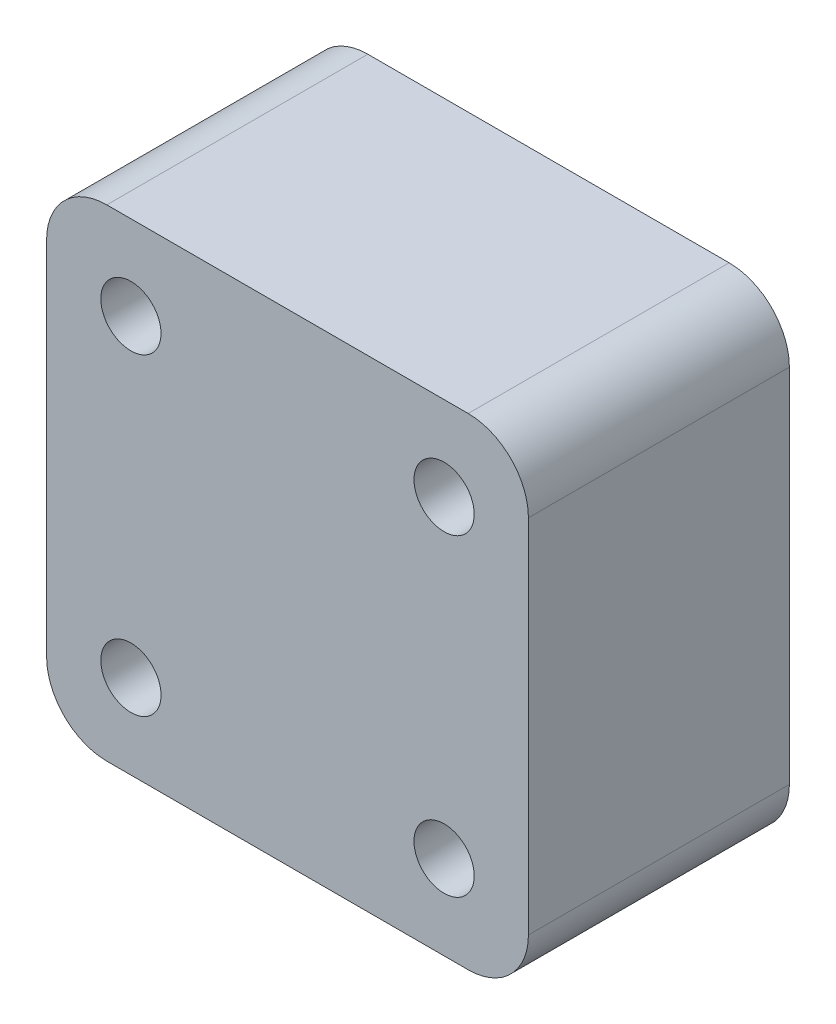
ISO-10303-21;
HEADER;
FILE_DESCRIPTION(('STEP AP214'),'2;1');
FILE_NAME('part.step','',(''),(''),'','','');
FILE_SCHEMA(('AUTOMOTIVE_DESIGN { 1 0 10303 214 1 1 1 1 }'));
ENDSEC;
DATA;
#1=APPLICATION_CONTEXT('core data for automotive mechanical design processes');
#2=APPLICATION_PROTOCOL_DEFINITION('international standard','automotive_design',2000,#1);
#3=PRODUCT_CONTEXT('',#1,'mechanical');
#4=PRODUCT('Part','Part','',(#3));
#5=PRODUCT_RELATED_PRODUCT_CATEGORY('part','',(#4));
#6=PRODUCT_DEFINITION_FORMATION('','',#4);
#7=PRODUCT_DEFINITION_CONTEXT('part definition',#1,'design');
#8=PRODUCT_DEFINITION('design','',#6,#7);
#9=PRODUCT_DEFINITION_SHAPE('','',#8);
#10=(LENGTH_UNIT() NAMED_UNIT(*) SI_UNIT(.MILLI.,.METRE.));
#11=(NAMED_UNIT(*) PLANE_ANGLE_UNIT() SI_UNIT($,.RADIAN.));
#12=(NAMED_UNIT(*) SI_UNIT($,.STERADIAN.) SOLID_ANGLE_UNIT());
#13=UNCERTAINTY_MEASURE_WITH_UNIT(LENGTH_MEASURE(1.E-05),#10,'distance_accuracy_value','');
#14=(GEOMETRIC_REPRESENTATION_CONTEXT(3) GLOBAL_UNCERTAINTY_ASSIGNED_CONTEXT((#13)) GLOBAL_UNIT_ASSIGNED_CONTEXT((#10,
#11,#12)) REPRESENTATION_CONTEXT('',''));
#15=CARTESIAN_POINT('',(0.,0.,0.));
#16=DIRECTION('',(0.,0.,1.));
#17=DIRECTION('',(1.,0.,0.));
#18=AXIS2_PLACEMENT_3D('',#15,#16,#17);
#19=CARTESIAN_POINT('',(24.,-24.,26.));
#20=DIRECTION('',(-1.,0.,0.));
#21=DIRECTION('',(0.,0.,1.));
#22=AXIS2_PLACEMENT_3D('',#19,#20,#21);
#23=PLANE('',#22);
#24=DIRECTION('',(0.,1.,0.));
#25=VECTOR('',#24,1.);
#26=CARTESIAN_POINT('',(24.,-24.,26.));
#27=LINE('',#26,#25);
#28=CARTESIAN_POINT('',(24.,-18.,26.));
#29=VERTEX_POINT('',#28);
#30=CARTESIAN_POINT('',(24.,18.,26.));
#31=VERTEX_POINT('',#30);
#32=EDGE_CURVE('E122',#29,#31,#27,.T.);
#33=ORIENTED_EDGE('',*,*,#32,.F.);
#34=DIRECTION('',(0.,0.,-1.));
#35=VECTOR('',#34,1.);
#36=CARTESIAN_POINT('',(24.,-18.,26.));
#37=LINE('',#36,#35);
#38=CARTESIAN_POINT('',(24.,-18.,0.));
#39=VERTEX_POINT('',#38);
#40=EDGE_CURVE('E107',#29,#39,#37,.T.);
#41=ORIENTED_EDGE('',*,*,#40,.T.);
#42=DIRECTION('',(0.,1.,0.));
#43=VECTOR('',#42,1.);
#44=CARTESIAN_POINT('',(24.,-24.,0.));
#45=LINE('',#44,#43);
#46=CARTESIAN_POINT('',(24.,18.,0.));
#47=VERTEX_POINT('',#46);
#48=EDGE_CURVE('E119',#39,#47,#45,.T.);
#49=ORIENTED_EDGE('',*,*,#48,.T.);
#50=DIRECTION('',(0.,0.,-1.));
#51=VECTOR('',#50,1.);
#52=CARTESIAN_POINT('',(24.,18.,26.));
#53=LINE('',#52,#51);
#54=EDGE_CURVE('E124',#47,#31,#53,.F.);
#55=ORIENTED_EDGE('',*,*,#54,.T.);
#56=EDGE_LOOP('',(#33,#41,#49,#55));
#57=FACE_BOUND('',#56,.T.);
#58=ADVANCED_FACE('F36',(#57),#23,.F.);
#59=CARTESIAN_POINT('',(-24.,24.,26.));
#60=DIRECTION('',(0.,-1.,0.));
#61=DIRECTION('',(0.,0.,-1.));
#62=AXIS2_PLACEMENT_3D('',#59,#60,#61);
#63=PLANE('',#62);
#64=DIRECTION('',(-1.,0.,0.));
#65=VECTOR('',#64,1.);
#66=CARTESIAN_POINT('',(-24.,24.,26.));
#67=LINE('',#66,#65);
#68=CARTESIAN_POINT('',(18.,24.,26.));
#69=VERTEX_POINT('',#68);
#70=CARTESIAN_POINT('',(-18.,24.,26.));
#71=VERTEX_POINT('',#70);
#72=EDGE_CURVE('E166',#69,#71,#67,.T.);
#73=ORIENTED_EDGE('',*,*,#72,.F.);
#74=DIRECTION('',(0.,0.,-1.));
#75=VECTOR('',#74,1.);
#76=CARTESIAN_POINT('',(18.,24.,26.));
#77=LINE('',#76,#75);
#78=CARTESIAN_POINT('',(18.,24.,0.));
#79=VERTEX_POINT('',#78);
#80=EDGE_CURVE('E11',#69,#79,#77,.T.);
#81=ORIENTED_EDGE('',*,*,#80,.T.);
#82=DIRECTION('',(-1.,0.,0.));
#83=VECTOR('',#82,1.);
#84=CARTESIAN_POINT('',(-24.,24.,0.));
#85=LINE('',#84,#83);
#86=CARTESIAN_POINT('',(-18.,24.,0.));
#87=VERTEX_POINT('',#86);
#88=EDGE_CURVE('E129',#79,#87,#85,.T.);
#89=ORIENTED_EDGE('',*,*,#88,.T.);
#90=DIRECTION('',(0.,0.,-1.));
#91=VECTOR('',#90,1.);
#92=CARTESIAN_POINT('',(-18.,24.,26.));
#93=LINE('',#92,#91);
#94=EDGE_CURVE('E44',#87,#71,#93,.F.);
#95=ORIENTED_EDGE('',*,*,#94,.T.);
#96=EDGE_LOOP('',(#73,#81,#89,#95));
#97=FACE_BOUND('',#96,.T.);
#98=ADVANCED_FACE('F165',(#97),#63,.F.);
#99=CARTESIAN_POINT('',(-24.,-24.,26.));
#100=DIRECTION('',(1.,0.,0.));
#101=DIRECTION('',(0.,0.,-1.));
#102=AXIS2_PLACEMENT_3D('',#99,#100,#101);
#103=PLANE('',#102);
#104=DIRECTION('',(0.,-1.,0.));
#105=VECTOR('',#104,1.);
#106=CARTESIAN_POINT('',(-24.,-24.,0.));
#107=LINE('',#106,#105);
#108=CARTESIAN_POINT('',(-24.,18.,0.));
#109=VERTEX_POINT('',#108);
#110=CARTESIAN_POINT('',(-24.,-18.,0.));
#111=VERTEX_POINT('',#110);
#112=EDGE_CURVE('E133',#109,#111,#107,.T.);
#113=ORIENTED_EDGE('',*,*,#112,.T.);
#114=DIRECTION('',(0.,0.,-1.));
#115=VECTOR('',#114,1.);
#116=CARTESIAN_POINT('',(-24.,-18.,26.));
#117=LINE('',#116,#115);
#118=CARTESIAN_POINT('',(-24.,-18.,26.));
#119=VERTEX_POINT('',#118);
#120=EDGE_CURVE('E51',#111,#119,#117,.F.);
#121=ORIENTED_EDGE('',*,*,#120,.T.);
#122=DIRECTION('',(0.,-1.,0.));
#123=VECTOR('',#122,1.);
#124=CARTESIAN_POINT('',(-24.,-24.,26.));
#125=LINE('',#124,#123);
#126=CARTESIAN_POINT('',(-24.,18.,26.));
#127=VERTEX_POINT('',#126);
#128=EDGE_CURVE('E172',#127,#119,#125,.T.);
#129=ORIENTED_EDGE('',*,*,#128,.F.);
#130=DIRECTION('',(0.,0.,-1.));
#131=VECTOR('',#130,1.);
#132=CARTESIAN_POINT('',(-24.,18.,26.));
#133=LINE('',#132,#131);
#134=EDGE_CURVE('E159',#127,#109,#133,.T.);
#135=ORIENTED_EDGE('',*,*,#134,.T.);
#136=EDGE_LOOP('',(#113,#121,#129,#135));
#137=FACE_BOUND('',#136,.T.);
#138=ADVANCED_FACE('F176',(#137),#103,.F.);
#139=CARTESIAN_POINT('',(-24.,-24.,26.));
#140=DIRECTION('',(0.,1.,0.));
#141=DIRECTION('',(0.,0.,1.));
#142=AXIS2_PLACEMENT_3D('',#139,#140,#141);
#143=PLANE('',#142);
#144=DIRECTION('',(1.,0.,0.));
#145=VECTOR('',#144,1.);
#146=CARTESIAN_POINT('',(-24.,-24.,0.));
#147=LINE('',#146,#145);
#148=CARTESIAN_POINT('',(-18.,-24.,0.));
#149=VERTEX_POINT('',#148);
#150=CARTESIAN_POINT('',(18.,-24.,0.));
#151=VERTEX_POINT('',#150);
#152=EDGE_CURVE('E143',#149,#151,#147,.T.);
#153=ORIENTED_EDGE('',*,*,#152,.T.);
#154=DIRECTION('',(0.,0.,-1.));
#155=VECTOR('',#154,1.);
#156=CARTESIAN_POINT('',(18.,-24.,26.));
#157=LINE('',#156,#155);
#158=CARTESIAN_POINT('',(18.,-24.,26.));
#159=VERTEX_POINT('',#158);
#160=EDGE_CURVE('E108',#151,#159,#157,.F.);
#161=ORIENTED_EDGE('',*,*,#160,.T.);
#162=DIRECTION('',(1.,0.,0.));
#163=VECTOR('',#162,1.);
#164=CARTESIAN_POINT('',(-24.,-24.,26.));
#165=LINE('',#164,#163);
#166=CARTESIAN_POINT('',(-18.,-24.,26.));
#167=VERTEX_POINT('',#166);
#168=EDGE_CURVE('E139',#167,#159,#165,.T.);
#169=ORIENTED_EDGE('',*,*,#168,.F.);
#170=DIRECTION('',(0.,0.,-1.));
#171=VECTOR('',#170,1.);
#172=CARTESIAN_POINT('',(-18.,-24.,26.));
#173=LINE('',#172,#171);
#174=EDGE_CURVE('E113',#167,#149,#173,.T.);
#175=ORIENTED_EDGE('',*,*,#174,.T.);
#176=EDGE_LOOP('',(#153,#161,#169,#175));
#177=FACE_BOUND('',#176,.T.);
#178=ADVANCED_FACE('F183',(#177),#143,.F.);
#179=CARTESIAN_POINT('',(0.,0.,26.));
#180=DIRECTION('',(0.,0.,-1.));
#181=DIRECTION('',(-1.,0.,0.));
#182=AXIS2_PLACEMENT_3D('',#179,#180,#181);
#183=PLANE('',#182);
#184=CARTESIAN_POINT('',(-15.6,15.6,26.));
#185=DIRECTION('',(0.,0.,1.));
#186=DIRECTION('',(-1.,0.,0.));
#187=AXIS2_PLACEMENT_3D('',#184,#185,#186);
#188=CIRCLE('',#187,3.);
#189=CARTESIAN_POINT('',(-18.6,15.6,26.));
#190=VERTEX_POINT('',#189);
#191=EDGE_CURVE('E196',#190,#190,#188,.T.);
#192=ORIENTED_EDGE('',*,*,#191,.F.);
#193=EDGE_LOOP('',(#192));
#194=FACE_BOUND('',#193,.T.);
#195=CARTESIAN_POINT('',(15.6,-15.6,26.));
#196=DIRECTION('',(0.,0.,1.));
#197=DIRECTION('',(-1.,0.,0.));
#198=AXIS2_PLACEMENT_3D('',#195,#196,#197);
#199=CIRCLE('',#198,3.);
#200=CARTESIAN_POINT('',(12.6,-15.6,26.));
#201=VERTEX_POINT('',#200);
#202=EDGE_CURVE('E189',#201,#201,#199,.T.);
#203=ORIENTED_EDGE('',*,*,#202,.F.);
#204=EDGE_LOOP('',(#203));
#205=FACE_BOUND('',#204,.T.);
#206=CARTESIAN_POINT('',(15.6,15.6,26.));
#207=DIRECTION('',(0.,0.,1.));
#208=DIRECTION('',(1.,0.,0.));
#209=AXIS2_PLACEMENT_3D('',#206,#207,#208);
#210=CIRCLE('',#209,3.);
#211=CARTESIAN_POINT('',(18.6,15.6,26.));
#212=VERTEX_POINT('',#211);
#213=EDGE_CURVE('E201',#212,#212,#210,.T.);
#214=ORIENTED_EDGE('',*,*,#213,.F.);
#215=EDGE_LOOP('',(#214));
#216=FACE_BOUND('',#215,.T.);
#217=CARTESIAN_POINT('',(-15.6,-15.6,26.));
#218=DIRECTION('',(0.,0.,1.));
#219=DIRECTION('',(1.,0.,0.));
#220=AXIS2_PLACEMENT_3D('',#217,#218,#219);
#221=CIRCLE('',#220,3.);
#222=CARTESIAN_POINT('',(-12.6,-15.6,26.));
#223=VERTEX_POINT('',#222);
#224=EDGE_CURVE('E136',#223,#223,#221,.T.);
#225=ORIENTED_EDGE('',*,*,#224,.F.);
#226=EDGE_LOOP('',(#225));
#227=FACE_BOUND('',#226,.T.);
#228=ORIENTED_EDGE('',*,*,#168,.T.);
#229=CARTESIAN_POINT('',(18.,-18.,26.));
#230=DIRECTION('',(0.,0.,-1.));
#231=DIRECTION('',(-1.,0.,0.));
#232=AXIS2_PLACEMENT_3D('',#229,#230,#231);
#233=CIRCLE('',#232,6.);
#234=EDGE_CURVE('E157',#159,#29,#233,.F.);
#235=ORIENTED_EDGE('',*,*,#234,.T.);
#236=ORIENTED_EDGE('',*,*,#32,.T.);
#237=CARTESIAN_POINT('',(18.,18.,26.));
#238=DIRECTION('',(0.,0.,-1.));
#239=DIRECTION('',(-1.,0.,0.));
#240=AXIS2_PLACEMENT_3D('',#237,#238,#239);
#241=CIRCLE('',#240,6.);
#242=EDGE_CURVE('E153',#31,#69,#241,.F.);
#243=ORIENTED_EDGE('',*,*,#242,.T.);
#244=ORIENTED_EDGE('',*,*,#72,.T.);
#245=CARTESIAN_POINT('',(-18.,18.,26.));
#246=DIRECTION('',(0.,0.,-1.));
#247=DIRECTION('',(-1.,0.,0.));
#248=AXIS2_PLACEMENT_3D('',#245,#246,#247);
#249=CIRCLE('',#248,6.);
#250=EDGE_CURVE('E58',#71,#127,#249,.F.);
#251=ORIENTED_EDGE('',*,*,#250,.T.);
#252=ORIENTED_EDGE('',*,*,#128,.T.);
#253=CARTESIAN_POINT('',(-18.,-18.,26.));
#254=DIRECTION('',(0.,0.,-1.));
#255=DIRECTION('',(-1.,0.,0.));
#256=AXIS2_PLACEMENT_3D('',#253,#254,#255);
#257=CIRCLE('',#256,6.);
#258=EDGE_CURVE('E155',#119,#167,#257,.F.);
#259=ORIENTED_EDGE('',*,*,#258,.T.);
#260=EDGE_LOOP('',(#228,#235,#236,#243,#244,#251,#252,#259));
#261=FACE_BOUND('',#260,.T.);
#262=ADVANCED_FACE('F170',(#194,#205,#216,#227,#261),#183,.F.);
#263=CARTESIAN_POINT('',(0.,0.,0.));
#264=DIRECTION('',(0.,0.,-1.));
#265=DIRECTION('',(-1.,0.,0.));
#266=AXIS2_PLACEMENT_3D('',#263,#264,#265);
#267=PLANE('',#266);
#268=CARTESIAN_POINT('',(-15.6,15.6,0.));
#269=DIRECTION('',(0.,0.,1.));
#270=DIRECTION('',(-1.,0.,0.));
#271=AXIS2_PLACEMENT_3D('',#268,#269,#270);
#272=CIRCLE('',#271,3.);
#273=CARTESIAN_POINT('',(-18.6,15.6,0.));
#274=VERTEX_POINT('',#273);
#275=EDGE_CURVE('E187',#274,#274,#272,.T.);
#276=ORIENTED_EDGE('',*,*,#275,.T.);
#277=EDGE_LOOP('',(#276));
#278=FACE_BOUND('',#277,.T.);
#279=CARTESIAN_POINT('',(15.6,-15.6,0.));
#280=DIRECTION('',(0.,0.,1.));
#281=DIRECTION('',(-1.,0.,0.));
#282=AXIS2_PLACEMENT_3D('',#279,#280,#281);
#283=CIRCLE('',#282,3.);
#284=CARTESIAN_POINT('',(12.6,-15.6,0.));
#285=VERTEX_POINT('',#284);
#286=EDGE_CURVE('E192',#285,#285,#283,.T.);
#287=ORIENTED_EDGE('',*,*,#286,.T.);
#288=EDGE_LOOP('',(#287));
#289=FACE_BOUND('',#288,.T.);
#290=CARTESIAN_POINT('',(15.6,15.6,0.));
#291=DIRECTION('',(0.,0.,1.));
#292=DIRECTION('',(1.,0.,0.));
#293=AXIS2_PLACEMENT_3D('',#290,#291,#292);
#294=CIRCLE('',#293,3.);
#295=CARTESIAN_POINT('',(18.6,15.6,0.));
#296=VERTEX_POINT('',#295);
#297=EDGE_CURVE('E193',#296,#296,#294,.T.);
#298=ORIENTED_EDGE('',*,*,#297,.T.);
#299=EDGE_LOOP('',(#298));
#300=FACE_BOUND('',#299,.T.);
#301=CARTESIAN_POINT('',(-15.6,-15.6,0.));
#302=DIRECTION('',(0.,0.,1.));
#303=DIRECTION('',(1.,0.,0.));
#304=AXIS2_PLACEMENT_3D('',#301,#302,#303);
#305=CIRCLE('',#304,3.);
#306=CARTESIAN_POINT('',(-12.6,-15.6,0.));
#307=VERTEX_POINT('',#306);
#308=EDGE_CURVE('E130',#307,#307,#305,.T.);
#309=ORIENTED_EDGE('',*,*,#308,.T.);
#310=EDGE_LOOP('',(#309));
#311=FACE_BOUND('',#310,.T.);
#312=ORIENTED_EDGE('',*,*,#48,.F.);
#313=CARTESIAN_POINT('',(18.,-18.,0.));
#314=DIRECTION('',(0.,0.,-1.));
#315=DIRECTION('',(-1.,0.,0.));
#316=AXIS2_PLACEMENT_3D('',#313,#314,#315);
#317=CIRCLE('',#316,6.);
#318=EDGE_CURVE('E103',#39,#151,#317,.T.);
#319=ORIENTED_EDGE('',*,*,#318,.T.);
#320=ORIENTED_EDGE('',*,*,#152,.F.);
#321=CARTESIAN_POINT('',(-18.,-18.,0.));
#322=DIRECTION('',(0.,0.,-1.));
#323=DIRECTION('',(-1.,0.,0.));
#324=AXIS2_PLACEMENT_3D('',#321,#322,#323);
#325=CIRCLE('',#324,6.);
#326=EDGE_CURVE('E114',#149,#111,#325,.T.);
#327=ORIENTED_EDGE('',*,*,#326,.T.);
#328=ORIENTED_EDGE('',*,*,#112,.F.);
#329=CARTESIAN_POINT('',(-18.,18.,0.));
#330=DIRECTION('',(0.,0.,-1.));
#331=DIRECTION('',(-1.,0.,0.));
#332=AXIS2_PLACEMENT_3D('',#329,#330,#331);
#333=CIRCLE('',#332,6.);
#334=EDGE_CURVE('E123',#109,#87,#333,.T.);
#335=ORIENTED_EDGE('',*,*,#334,.T.);
#336=ORIENTED_EDGE('',*,*,#88,.F.);
#337=CARTESIAN_POINT('',(18.,18.,0.));
#338=DIRECTION('',(0.,0.,-1.));
#339=DIRECTION('',(-1.,0.,0.));
#340=AXIS2_PLACEMENT_3D('',#337,#338,#339);
#341=CIRCLE('',#340,6.);
#342=EDGE_CURVE('E128',#79,#47,#341,.T.);
#343=ORIENTED_EDGE('',*,*,#342,.T.);
#344=EDGE_LOOP('',(#312,#319,#320,#327,#328,#335,#336,#343));
#345=FACE_BOUND('',#344,.T.);
#346=ADVANCED_FACE('F126',(#278,#289,#300,#311,#345),#267,.T.);
#347=CARTESIAN_POINT('',(-15.6,-15.6,0.));
#348=DIRECTION('',(0.,0.,1.));
#349=DIRECTION('',(1.,0.,0.));
#350=AXIS2_PLACEMENT_3D('',#347,#348,#349);
#351=CYLINDRICAL_SURFACE('',#350,3.);
#352=ORIENTED_EDGE('',*,*,#308,.F.);
#353=EDGE_LOOP('',(#352));
#354=FACE_BOUND('',#353,.T.);
#355=ORIENTED_EDGE('',*,*,#224,.T.);
#356=EDGE_LOOP('',(#355));
#357=FACE_BOUND('',#356,.T.);
#358=ADVANCED_FACE('F213',(#354,#357),#351,.F.);
#359=CARTESIAN_POINT('',(15.6,15.6,0.));
#360=DIRECTION('',(0.,0.,1.));
#361=DIRECTION('',(1.,0.,0.));
#362=AXIS2_PLACEMENT_3D('',#359,#360,#361);
#363=CYLINDRICAL_SURFACE('',#362,3.);
#364=ORIENTED_EDGE('',*,*,#297,.F.);
#365=EDGE_LOOP('',(#364));
#366=FACE_BOUND('',#365,.T.);
#367=ORIENTED_EDGE('',*,*,#213,.T.);
#368=EDGE_LOOP('',(#367));
#369=FACE_BOUND('',#368,.T.);
#370=ADVANCED_FACE('F209',(#366,#369),#363,.F.);
#371=CARTESIAN_POINT('',(15.6,-15.6,0.));
#372=DIRECTION('',(0.,0.,1.));
#373=DIRECTION('',(1.,0.,0.));
#374=AXIS2_PLACEMENT_3D('',#371,#372,#373);
#375=CYLINDRICAL_SURFACE('',#374,3.);
#376=ORIENTED_EDGE('',*,*,#286,.F.);
#377=EDGE_LOOP('',(#376));
#378=FACE_BOUND('',#377,.T.);
#379=ORIENTED_EDGE('',*,*,#202,.T.);
#380=EDGE_LOOP('',(#379));
#381=FACE_BOUND('',#380,.T.);
#382=ADVANCED_FACE('F212',(#378,#381),#375,.F.);
#383=CARTESIAN_POINT('',(-15.6,15.6,0.));
#384=DIRECTION('',(0.,0.,1.));
#385=DIRECTION('',(1.,0.,0.));
#386=AXIS2_PLACEMENT_3D('',#383,#384,#385);
#387=CYLINDRICAL_SURFACE('',#386,3.);
#388=ORIENTED_EDGE('',*,*,#275,.F.);
#389=EDGE_LOOP('',(#388));
#390=FACE_BOUND('',#389,.T.);
#391=ORIENTED_EDGE('',*,*,#191,.T.);
#392=EDGE_LOOP('',(#391));
#393=FACE_BOUND('',#392,.T.);
#394=ADVANCED_FACE('F243',(#390,#393),#387,.F.);
#395=CARTESIAN_POINT('',(18.,-18.,26.));
#396=DIRECTION('',(0.,0.,-1.));
#397=DIRECTION('',(-1.,0.,0.));
#398=AXIS2_PLACEMENT_3D('',#395,#396,#397);
#399=CYLINDRICAL_SURFACE('',#398,6.);
#400=ORIENTED_EDGE('',*,*,#234,.F.);
#401=ORIENTED_EDGE('',*,*,#160,.F.);
#402=ORIENTED_EDGE('',*,*,#318,.F.);
#403=ORIENTED_EDGE('',*,*,#40,.F.);
#404=EDGE_LOOP('',(#400,#401,#402,#403));
#405=FACE_BOUND('',#404,.T.);
#406=ADVANCED_FACE('F106',(#405),#399,.T.);
#407=CARTESIAN_POINT('',(-18.,-18.,26.));
#408=DIRECTION('',(0.,0.,-1.));
#409=DIRECTION('',(-1.,0.,0.));
#410=AXIS2_PLACEMENT_3D('',#407,#408,#409);
#411=CYLINDRICAL_SURFACE('',#410,6.);
#412=ORIENTED_EDGE('',*,*,#258,.F.);
#413=ORIENTED_EDGE('',*,*,#120,.F.);
#414=ORIENTED_EDGE('',*,*,#326,.F.);
#415=ORIENTED_EDGE('',*,*,#174,.F.);
#416=EDGE_LOOP('',(#412,#413,#414,#415));
#417=FACE_BOUND('',#416,.T.);
#418=ADVANCED_FACE('F180',(#417),#411,.T.);
#419=CARTESIAN_POINT('',(18.,18.,26.));
#420=DIRECTION('',(0.,0.,-1.));
#421=DIRECTION('',(-1.,0.,0.));
#422=AXIS2_PLACEMENT_3D('',#419,#420,#421);
#423=CYLINDRICAL_SURFACE('',#422,6.);
#424=ORIENTED_EDGE('',*,*,#242,.F.);
#425=ORIENTED_EDGE('',*,*,#54,.F.);
#426=ORIENTED_EDGE('',*,*,#342,.F.);
#427=ORIENTED_EDGE('',*,*,#80,.F.);
#428=EDGE_LOOP('',(#424,#425,#426,#427));
#429=FACE_BOUND('',#428,.T.);
#430=ADVANCED_FACE('F245',(#429),#423,.T.);
#431=CARTESIAN_POINT('',(-18.,18.,26.));
#432=DIRECTION('',(0.,0.,-1.));
#433=DIRECTION('',(-1.,0.,0.));
#434=AXIS2_PLACEMENT_3D('',#431,#432,#433);
#435=CYLINDRICAL_SURFACE('',#434,6.);
#436=ORIENTED_EDGE('',*,*,#250,.F.);
#437=ORIENTED_EDGE('',*,*,#94,.F.);
#438=ORIENTED_EDGE('',*,*,#334,.F.);
#439=ORIENTED_EDGE('',*,*,#134,.F.);
#440=EDGE_LOOP('',(#436,#437,#438,#439));
#441=FACE_BOUND('',#440,.T.);
#442=ADVANCED_FACE('F38',(#441),#435,.T.);
#443=CLOSED_SHELL('',(#58,#98,#138,#178,#262,#346,#358,#370,#382,#394,#406,#418,#430,#442));
#444=MANIFOLD_SOLID_BREP('B2',#443);
#445=ADVANCED_BREP_SHAPE_REPRESENTATION('',(#18,#444),#14);
#446=SHAPE_DEFINITION_REPRESENTATION(#9,#445);
ENDSEC;
END-ISO-10303-21;
